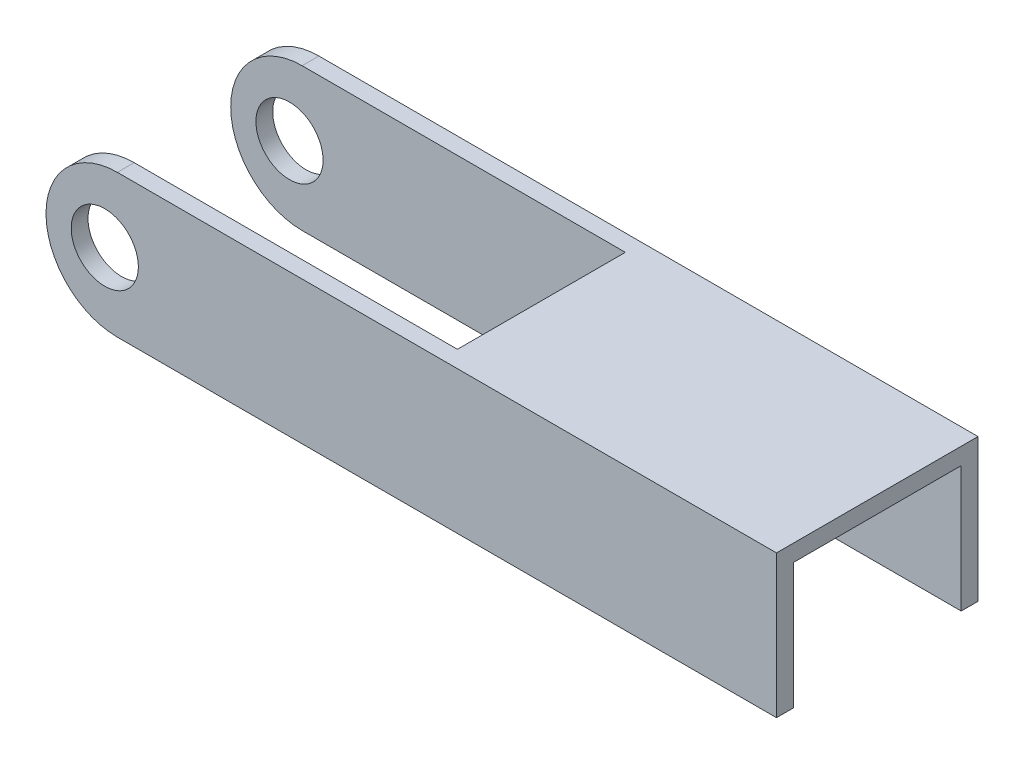
ISO-10303-21;
HEADER;
FILE_DESCRIPTION(('STEP AP214'),'2;1');
FILE_NAME('part.step','',(''),(''),'','','');
FILE_SCHEMA(('AUTOMOTIVE_DESIGN { 1 0 10303 214 1 1 1 1 }'));
ENDSEC;
DATA;
#1=APPLICATION_CONTEXT('core data for automotive mechanical design processes');
#2=APPLICATION_PROTOCOL_DEFINITION('international standard','automotive_design',2000,#1);
#3=PRODUCT_CONTEXT('',#1,'mechanical');
#4=PRODUCT('Part','Part','',(#3));
#5=PRODUCT_RELATED_PRODUCT_CATEGORY('part','',(#4));
#6=PRODUCT_DEFINITION_FORMATION('','',#4);
#7=PRODUCT_DEFINITION_CONTEXT('part definition',#1,'design');
#8=PRODUCT_DEFINITION('design','',#6,#7);
#9=PRODUCT_DEFINITION_SHAPE('','',#8);
#10=(LENGTH_UNIT() NAMED_UNIT(*) SI_UNIT(.MILLI.,.METRE.));
#11=(NAMED_UNIT(*) PLANE_ANGLE_UNIT() SI_UNIT($,.RADIAN.));
#12=(NAMED_UNIT(*) SI_UNIT($,.STERADIAN.) SOLID_ANGLE_UNIT());
#13=UNCERTAINTY_MEASURE_WITH_UNIT(LENGTH_MEASURE(1.E-05),#10,'distance_accuracy_value','');
#14=(GEOMETRIC_REPRESENTATION_CONTEXT(3) GLOBAL_UNCERTAINTY_ASSIGNED_CONTEXT((#13)) GLOBAL_UNIT_ASSIGNED_CONTEXT((#10,
#11,#12)) REPRESENTATION_CONTEXT('',''));
#15=CARTESIAN_POINT('',(0.,0.,0.));
#16=DIRECTION('',(0.,0.,1.));
#17=DIRECTION('',(1.,0.,0.));
#18=AXIS2_PLACEMENT_3D('',#15,#16,#17);
#19=CARTESIAN_POINT('',(-4.30348318368607,0.171520647505176,0.));
#20=DIRECTION('',(0.,0.,1.));
#21=DIRECTION('',(1.,0.,0.));
#22=AXIS2_PLACEMENT_3D('',#19,#20,#21);
#23=PLANE('',#22);
#24=CARTESIAN_POINT('',(-5.80348318368607,0.171520647505176,0.));
#25=DIRECTION('',(0.,0.,1.));
#26=DIRECTION('',(1.,0.,0.));
#27=AXIS2_PLACEMENT_3D('',#24,#25,#26);
#28=CIRCLE('',#27,4.);
#29=CARTESIAN_POINT('',(-1.80348318368607,0.171520647505176,0.));
#30=VERTEX_POINT('',#29);
#31=EDGE_CURVE('E191',#30,#30,#28,.T.);
#32=ORIENTED_EDGE('',*,*,#31,.T.);
#33=EDGE_LOOP('',(#32));
#34=FACE_BOUND('',#33,.T.);
#35=DIRECTION('',(0.,1.,0.));
#36=VECTOR('',#35,1.);
#37=CARTESIAN_POINT('',(34.1965168163139,8.67152064750518,0.));
#38=LINE('',#37,#36);
#39=CARTESIAN_POINT('',(34.1965168163139,6.67152064750518,0.));
#40=VERTEX_POINT('',#39);
#41=CARTESIAN_POINT('',(34.1965168163139,8.67152064750518,0.));
#42=VERTEX_POINT('',#41);
#43=EDGE_CURVE('E177',#40,#42,#38,.T.);
#44=ORIENTED_EDGE('',*,*,#43,.F.);
#45=DIRECTION('',(-1.,0.,0.));
#46=VECTOR('',#45,1.);
#47=CARTESIAN_POINT('',(34.1965168163139,6.67152064750518,0.));
#48=LINE('',#47,#46);
#49=CARTESIAN_POINT('',(74.1965168163139,6.67152064750518,0.));
#50=VERTEX_POINT('',#49);
#51=EDGE_CURVE('E62',#50,#40,#48,.T.);
#52=ORIENTED_EDGE('',*,*,#51,.F.);
#53=DIRECTION('',(0.,1.,0.));
#54=VECTOR('',#53,1.);
#55=CARTESIAN_POINT('',(74.1965168163139,8.67152064750518,0.));
#56=LINE('',#55,#54);
#57=CARTESIAN_POINT('',(74.1965168163139,-8.32847935249482,0.));
#58=VERTEX_POINT('',#57);
#59=EDGE_CURVE('E199',#58,#50,#56,.T.);
#60=ORIENTED_EDGE('',*,*,#59,.F.);
#61=DIRECTION('',(1.,0.,0.));
#62=VECTOR('',#61,1.);
#63=CARTESIAN_POINT('',(74.1965168163139,-8.32847935249482,0.));
#64=LINE('',#63,#62);
#65=CARTESIAN_POINT('',(-4.30348318368607,-8.32847935249482,0.));
#66=VERTEX_POINT('',#65);
#67=EDGE_CURVE('E207',#66,#58,#64,.T.);
#68=ORIENTED_EDGE('',*,*,#67,.F.);
#69=CARTESIAN_POINT('',(-4.30348318368607,0.171520647505176,0.));
#70=DIRECTION('',(0.,0.,1.));
#71=DIRECTION('',(1.,0.,0.));
#72=AXIS2_PLACEMENT_3D('',#69,#70,#71);
#73=CIRCLE('',#72,8.5);
#74=CARTESIAN_POINT('',(-4.30348318368607,8.67152064750518,0.));
#75=VERTEX_POINT('',#74);
#76=EDGE_CURVE('E205',#75,#66,#73,.T.);
#77=ORIENTED_EDGE('',*,*,#76,.F.);
#78=DIRECTION('',(-1.,0.,0.));
#79=VECTOR('',#78,1.);
#80=CARTESIAN_POINT('',(-4.30348318368607,8.67152064750518,0.));
#81=LINE('',#80,#79);
#82=EDGE_CURVE('E68',#42,#75,#81,.T.);
#83=ORIENTED_EDGE('',*,*,#82,.F.);
#84=EDGE_LOOP('',(#44,#52,#60,#68,#77,#83));
#85=FACE_BOUND('',#84,.T.);
#86=ADVANCED_FACE('F47',(#34,#85),#23,.F.);
#87=CARTESIAN_POINT('',(-4.30348318368607,0.171520647505176,2.));
#88=DIRECTION('',(0.,0.,1.));
#89=DIRECTION('',(1.,0.,0.));
#90=AXIS2_PLACEMENT_3D('',#87,#88,#89);
#91=PLANE('',#90);
#92=DIRECTION('',(-1.,0.,0.));
#93=VECTOR('',#92,1.);
#94=CARTESIAN_POINT('',(4.19651681631393,8.67152064750518,2.));
#95=LINE('',#94,#93);
#96=CARTESIAN_POINT('',(74.1965168163139,8.67152064750518,2.));
#97=VERTEX_POINT('',#96);
#98=CARTESIAN_POINT('',(-4.30348318368607,8.67152064750518,2.));
#99=VERTEX_POINT('',#98);
#100=EDGE_CURVE('E130',#97,#99,#95,.T.);
#101=ORIENTED_EDGE('',*,*,#100,.T.);
#102=CARTESIAN_POINT('',(-4.30348318368607,0.171520647505176,2.));
#103=DIRECTION('',(0.,0.,1.));
#104=DIRECTION('',(1.,0.,0.));
#105=AXIS2_PLACEMENT_3D('',#102,#103,#104);
#106=CIRCLE('',#105,8.5);
#107=CARTESIAN_POINT('',(-4.30348318368607,-8.32847935249482,2.));
#108=VERTEX_POINT('',#107);
#109=EDGE_CURVE('E198',#99,#108,#106,.T.);
#110=ORIENTED_EDGE('',*,*,#109,.T.);
#111=DIRECTION('',(1.,0.,0.));
#112=VECTOR('',#111,1.);
#113=CARTESIAN_POINT('',(74.1965168163139,-8.32847935249482,2.));
#114=LINE('',#113,#112);
#115=CARTESIAN_POINT('',(74.1965168163139,-8.32847935249482,2.));
#116=VERTEX_POINT('',#115);
#117=EDGE_CURVE('E201',#108,#116,#114,.T.);
#118=ORIENTED_EDGE('',*,*,#117,.T.);
#119=DIRECTION('',(0.,1.,0.));
#120=VECTOR('',#119,1.);
#121=CARTESIAN_POINT('',(74.1965168163139,8.67152064750518,2.));
#122=LINE('',#121,#120);
#123=EDGE_CURVE('E135',#116,#97,#122,.T.);
#124=ORIENTED_EDGE('',*,*,#123,.T.);
#125=EDGE_LOOP('',(#101,#110,#118,#124));
#126=FACE_BOUND('',#125,.T.);
#127=CARTESIAN_POINT('',(-5.80348318368607,0.171520647505176,2.));
#128=DIRECTION('',(0.,0.,1.));
#129=DIRECTION('',(1.,0.,0.));
#130=AXIS2_PLACEMENT_3D('',#127,#128,#129);
#131=CIRCLE('',#130,4.);
#132=CARTESIAN_POINT('',(-1.80348318368607,0.171520647505176,2.));
#133=VERTEX_POINT('',#132);
#134=EDGE_CURVE('E192',#133,#133,#131,.T.);
#135=ORIENTED_EDGE('',*,*,#134,.F.);
#136=EDGE_LOOP('',(#135));
#137=FACE_BOUND('',#136,.T.);
#138=ADVANCED_FACE('F247',(#126,#137),#91,.T.);
#139=CARTESIAN_POINT('',(-4.30348318368607,8.67152064750518,2.));
#140=DIRECTION('',(0.,-1.,0.));
#141=DIRECTION('',(0.,0.,-1.));
#142=AXIS2_PLACEMENT_3D('',#139,#140,#141);
#143=PLANE('',#142);
#144=DIRECTION('',(0.,0.,-1.));
#145=VECTOR('',#144,1.);
#146=CARTESIAN_POINT('',(74.1965168163139,8.67152064750518,2.));
#147=LINE('',#146,#145);
#148=CARTESIAN_POINT('',(74.1965168163139,8.67152064750518,-22.));
#149=VERTEX_POINT('',#148);
#150=EDGE_CURVE('E124',#97,#149,#147,.T.);
#151=ORIENTED_EDGE('',*,*,#150,.T.);
#152=DIRECTION('',(-1.,0.,0.));
#153=VECTOR('',#152,1.);
#154=CARTESIAN_POINT('',(4.19651681631393,8.67152064750518,-22.));
#155=LINE('',#154,#153);
#156=CARTESIAN_POINT('',(-4.30348318368607,8.67152064750518,-22.));
#157=VERTEX_POINT('',#156);
#158=EDGE_CURVE('E127',#149,#157,#155,.T.);
#159=ORIENTED_EDGE('',*,*,#158,.T.);
#160=DIRECTION('',(0.,0.,1.));
#161=VECTOR('',#160,1.);
#162=CARTESIAN_POINT('',(-4.30348318368607,8.67152064750518,-22.));
#163=LINE('',#162,#161);
#164=CARTESIAN_POINT('',(-4.30348318368607,8.67152064750518,-20.));
#165=VERTEX_POINT('',#164);
#166=EDGE_CURVE('E157',#157,#165,#163,.T.);
#167=ORIENTED_EDGE('',*,*,#166,.T.);
#168=DIRECTION('',(-1.,0.,0.));
#169=VECTOR('',#168,1.);
#170=CARTESIAN_POINT('',(-4.30348318368607,8.67152064750518,-20.));
#171=LINE('',#170,#169);
#172=CARTESIAN_POINT('',(34.1965168163139,8.67152064750518,-20.));
#173=VERTEX_POINT('',#172);
#174=EDGE_CURVE('E146',#173,#165,#171,.T.);
#175=ORIENTED_EDGE('',*,*,#174,.F.);
#176=DIRECTION('',(0.,0.,1.));
#177=VECTOR('',#176,1.);
#178=CARTESIAN_POINT('',(34.1965168163139,8.67152064750518,-20.));
#179=LINE('',#178,#177);
#180=EDGE_CURVE('E180',#173,#42,#179,.T.);
#181=ORIENTED_EDGE('',*,*,#180,.T.);
#182=ORIENTED_EDGE('',*,*,#82,.T.);
#183=DIRECTION('',(0.,0.,-1.));
#184=VECTOR('',#183,1.);
#185=CARTESIAN_POINT('',(-4.30348318368607,8.67152064750518,2.));
#186=LINE('',#185,#184);
#187=EDGE_CURVE('E13',#99,#75,#186,.T.);
#188=ORIENTED_EDGE('',*,*,#187,.F.);
#189=ORIENTED_EDGE('',*,*,#100,.F.);
#190=EDGE_LOOP('',(#151,#159,#167,#175,#181,#182,#188,#189));
#191=FACE_BOUND('',#190,.T.);
#192=ADVANCED_FACE('F49',(#191),#143,.F.);
#193=CARTESIAN_POINT('',(-4.30348318368607,0.171520647505176,2.));
#194=DIRECTION('',(0.,0.,-1.));
#195=DIRECTION('',(-1.,0.,0.));
#196=AXIS2_PLACEMENT_3D('',#193,#194,#195);
#197=CYLINDRICAL_SURFACE('',#196,8.5);
#198=ORIENTED_EDGE('',*,*,#76,.T.);
#199=DIRECTION('',(0.,0.,-1.));
#200=VECTOR('',#199,1.);
#201=CARTESIAN_POINT('',(-4.30348318368607,-8.32847935249482,2.));
#202=LINE('',#201,#200);
#203=EDGE_CURVE('E55',#108,#66,#202,.T.);
#204=ORIENTED_EDGE('',*,*,#203,.F.);
#205=ORIENTED_EDGE('',*,*,#109,.F.);
#206=ORIENTED_EDGE('',*,*,#187,.T.);
#207=EDGE_LOOP('',(#198,#204,#205,#206));
#208=FACE_BOUND('',#207,.T.);
#209=ADVANCED_FACE('F260',(#208),#197,.T.);
#210=CARTESIAN_POINT('',(74.1965168163139,-8.32847935249482,2.));
#211=DIRECTION('',(0.,1.,0.));
#212=DIRECTION('',(0.,0.,1.));
#213=AXIS2_PLACEMENT_3D('',#210,#211,#212);
#214=PLANE('',#213);
#215=ORIENTED_EDGE('',*,*,#67,.T.);
#216=DIRECTION('',(0.,0.,-1.));
#217=VECTOR('',#216,1.);
#218=CARTESIAN_POINT('',(74.1965168163139,-8.32847935249482,2.));
#219=LINE('',#218,#217);
#220=EDGE_CURVE('E134',#116,#58,#219,.T.);
#221=ORIENTED_EDGE('',*,*,#220,.F.);
#222=ORIENTED_EDGE('',*,*,#117,.F.);
#223=ORIENTED_EDGE('',*,*,#203,.T.);
#224=EDGE_LOOP('',(#215,#221,#222,#223));
#225=FACE_BOUND('',#224,.T.);
#226=ADVANCED_FACE('F216',(#225),#214,.F.);
#227=CARTESIAN_POINT('',(74.1965168163139,8.67152064750518,2.));
#228=DIRECTION('',(-1.,0.,0.));
#229=DIRECTION('',(0.,0.,1.));
#230=AXIS2_PLACEMENT_3D('',#227,#228,#229);
#231=PLANE('',#230);
#232=ORIENTED_EDGE('',*,*,#59,.T.);
#233=DIRECTION('',(0.,0.,1.));
#234=VECTOR('',#233,1.);
#235=CARTESIAN_POINT('',(74.1965168163139,6.67152064750518,-20.));
#236=LINE('',#235,#234);
#237=CARTESIAN_POINT('',(74.1965168163139,6.67152064750518,-20.));
#238=VERTEX_POINT('',#237);
#239=EDGE_CURVE('E188',#238,#50,#236,.T.);
#240=ORIENTED_EDGE('',*,*,#239,.F.);
#241=DIRECTION('',(0.,1.,0.));
#242=VECTOR('',#241,1.);
#243=CARTESIAN_POINT('',(74.1965168163139,8.67152064750518,-20.));
#244=LINE('',#243,#242);
#245=CARTESIAN_POINT('',(74.1965168163139,-8.32847935249482,-20.));
#246=VERTEX_POINT('',#245);
#247=EDGE_CURVE('E158',#246,#238,#244,.T.);
#248=ORIENTED_EDGE('',*,*,#247,.F.);
#249=DIRECTION('',(0.,0.,1.));
#250=VECTOR('',#249,1.);
#251=CARTESIAN_POINT('',(74.1965168163139,-8.32847935249482,-22.));
#252=LINE('',#251,#250);
#253=CARTESIAN_POINT('',(74.1965168163139,-8.32847935249482,-22.));
#254=VERTEX_POINT('',#253);
#255=EDGE_CURVE('E150',#254,#246,#252,.T.);
#256=ORIENTED_EDGE('',*,*,#255,.F.);
#257=DIRECTION('',(0.,1.,0.));
#258=VECTOR('',#257,1.);
#259=CARTESIAN_POINT('',(74.1965168163139,8.67152064750518,-22.));
#260=LINE('',#259,#258);
#261=EDGE_CURVE('E142',#254,#149,#260,.T.);
#262=ORIENTED_EDGE('',*,*,#261,.T.);
#263=ORIENTED_EDGE('',*,*,#150,.F.);
#264=ORIENTED_EDGE('',*,*,#123,.F.);
#265=ORIENTED_EDGE('',*,*,#220,.T.);
#266=EDGE_LOOP('',(#232,#240,#248,#256,#262,#263,#264,#265));
#267=FACE_BOUND('',#266,.T.);
#268=ADVANCED_FACE('F148',(#267),#231,.F.);
#269=CARTESIAN_POINT('',(-5.80348318368607,0.171520647505176,2.));
#270=DIRECTION('',(0.,0.,-1.));
#271=DIRECTION('',(-1.,0.,0.));
#272=AXIS2_PLACEMENT_3D('',#269,#270,#271);
#273=CYLINDRICAL_SURFACE('',#272,4.);
#274=ORIENTED_EDGE('',*,*,#134,.T.);
#275=EDGE_LOOP('',(#274));
#276=FACE_BOUND('',#275,.T.);
#277=ORIENTED_EDGE('',*,*,#31,.F.);
#278=EDGE_LOOP('',(#277));
#279=FACE_BOUND('',#278,.T.);
#280=ADVANCED_FACE('F243',(#276,#279),#273,.F.);
#281=CARTESIAN_POINT('',(34.1965168163139,6.67152064750518,-20.));
#282=DIRECTION('',(0.,1.,0.));
#283=DIRECTION('',(0.,0.,1.));
#284=AXIS2_PLACEMENT_3D('',#281,#282,#283);
#285=PLANE('',#284);
#286=ORIENTED_EDGE('',*,*,#51,.T.);
#287=DIRECTION('',(0.,0.,1.));
#288=VECTOR('',#287,1.);
#289=CARTESIAN_POINT('',(34.1965168163139,6.67152064750518,-20.));
#290=LINE('',#289,#288);
#291=CARTESIAN_POINT('',(34.1965168163139,6.67152064750518,-20.));
#292=VERTEX_POINT('',#291);
#293=EDGE_CURVE('E185',#292,#40,#290,.T.);
#294=ORIENTED_EDGE('',*,*,#293,.F.);
#295=DIRECTION('',(-1.,0.,0.));
#296=VECTOR('',#295,1.);
#297=CARTESIAN_POINT('',(34.1965168163139,6.67152064750518,-20.));
#298=LINE('',#297,#296);
#299=EDGE_CURVE('E173',#238,#292,#298,.T.);
#300=ORIENTED_EDGE('',*,*,#299,.F.);
#301=ORIENTED_EDGE('',*,*,#239,.T.);
#302=EDGE_LOOP('',(#286,#294,#300,#301));
#303=FACE_BOUND('',#302,.T.);
#304=ADVANCED_FACE('F222',(#303),#285,.F.);
#305=CARTESIAN_POINT('',(34.1965168163139,8.67152064750518,-20.));
#306=DIRECTION('',(1.,0.,0.));
#307=DIRECTION('',(0.,0.,-1.));
#308=AXIS2_PLACEMENT_3D('',#305,#306,#307);
#309=PLANE('',#308);
#310=ORIENTED_EDGE('',*,*,#43,.T.);
#311=ORIENTED_EDGE('',*,*,#180,.F.);
#312=DIRECTION('',(0.,1.,0.));
#313=VECTOR('',#312,1.);
#314=CARTESIAN_POINT('',(34.1965168163139,8.67152064750518,-20.));
#315=LINE('',#314,#313);
#316=EDGE_CURVE('E176',#292,#173,#315,.T.);
#317=ORIENTED_EDGE('',*,*,#316,.F.);
#318=ORIENTED_EDGE('',*,*,#293,.T.);
#319=EDGE_LOOP('',(#310,#311,#317,#318));
#320=FACE_BOUND('',#319,.T.);
#321=ADVANCED_FACE('F234',(#320),#309,.F.);
#322=CARTESIAN_POINT('',(-4.30348318368607,0.171520647505176,-20.));
#323=DIRECTION('',(0.,0.,-1.));
#324=DIRECTION('',(1.,0.,0.));
#325=AXIS2_PLACEMENT_3D('',#322,#323,#324);
#326=PLANE('',#325);
#327=CARTESIAN_POINT('',(-5.80348318368607,0.171520647505176,-20.));
#328=DIRECTION('',(0.,0.,1.));
#329=DIRECTION('',(1.,0.,0.));
#330=AXIS2_PLACEMENT_3D('',#327,#328,#329);
#331=CIRCLE('',#330,4.);
#332=CARTESIAN_POINT('',(-1.80348318368607,0.171520647505176,-20.));
#333=VERTEX_POINT('',#332);
#334=EDGE_CURVE('E338',#333,#333,#331,.T.);
#335=ORIENTED_EDGE('',*,*,#334,.F.);
#336=EDGE_LOOP('',(#335));
#337=FACE_BOUND('',#336,.T.);
#338=ORIENTED_EDGE('',*,*,#247,.T.);
#339=ORIENTED_EDGE('',*,*,#299,.T.);
#340=ORIENTED_EDGE('',*,*,#316,.T.);
#341=ORIENTED_EDGE('',*,*,#174,.T.);
#342=CARTESIAN_POINT('',(-4.30348318368607,0.171520647505176,-20.));
#343=DIRECTION('',(0.,0.,1.));
#344=DIRECTION('',(1.,0.,0.));
#345=AXIS2_PLACEMENT_3D('',#342,#343,#344);
#346=CIRCLE('',#345,8.5);
#347=CARTESIAN_POINT('',(-4.30348318368607,-8.32847935249482,-20.));
#348=VERTEX_POINT('',#347);
#349=EDGE_CURVE('E165',#165,#348,#346,.T.);
#350=ORIENTED_EDGE('',*,*,#349,.T.);
#351=DIRECTION('',(1.,0.,0.));
#352=VECTOR('',#351,1.);
#353=CARTESIAN_POINT('',(74.1965168163139,-8.32847935249482,-20.));
#354=LINE('',#353,#352);
#355=EDGE_CURVE('E161',#348,#246,#354,.T.);
#356=ORIENTED_EDGE('',*,*,#355,.T.);
#357=EDGE_LOOP('',(#338,#339,#340,#341,#350,#356));
#358=FACE_BOUND('',#357,.T.);
#359=ADVANCED_FACE('F225',(#337,#358),#326,.F.);
#360=CARTESIAN_POINT('',(74.1965168163139,-8.32847935249482,-22.));
#361=DIRECTION('',(0.,-1.,0.));
#362=DIRECTION('',(0.,0.,-1.));
#363=AXIS2_PLACEMENT_3D('',#360,#361,#362);
#364=PLANE('',#363);
#365=ORIENTED_EDGE('',*,*,#355,.F.);
#366=DIRECTION('',(0.,0.,1.));
#367=VECTOR('',#366,1.);
#368=CARTESIAN_POINT('',(-4.30348318368607,-8.32847935249482,-22.));
#369=LINE('',#368,#367);
#370=CARTESIAN_POINT('',(-4.30348318368607,-8.32847935249482,-22.));
#371=VERTEX_POINT('',#370);
#372=EDGE_CURVE('E170',#371,#348,#369,.T.);
#373=ORIENTED_EDGE('',*,*,#372,.F.);
#374=DIRECTION('',(1.,0.,0.));
#375=VECTOR('',#374,1.);
#376=CARTESIAN_POINT('',(74.1965168163139,-8.32847935249482,-22.));
#377=LINE('',#376,#375);
#378=EDGE_CURVE('E151',#371,#254,#377,.T.);
#379=ORIENTED_EDGE('',*,*,#378,.T.);
#380=ORIENTED_EDGE('',*,*,#255,.T.);
#381=EDGE_LOOP('',(#365,#373,#379,#380));
#382=FACE_BOUND('',#381,.T.);
#383=ADVANCED_FACE('F230',(#382),#364,.T.);
#384=CARTESIAN_POINT('',(-4.30348318368607,0.171520647505176,-22.));
#385=DIRECTION('',(0.,0.,1.));
#386=DIRECTION('',(1.,0.,0.));
#387=AXIS2_PLACEMENT_3D('',#384,#385,#386);
#388=CYLINDRICAL_SURFACE('',#387,8.5);
#389=ORIENTED_EDGE('',*,*,#349,.F.);
#390=ORIENTED_EDGE('',*,*,#166,.F.);
#391=CARTESIAN_POINT('',(-4.30348318368607,0.171520647505176,-22.));
#392=DIRECTION('',(0.,0.,1.));
#393=DIRECTION('',(1.,0.,0.));
#394=AXIS2_PLACEMENT_3D('',#391,#392,#393);
#395=CIRCLE('',#394,8.5);
#396=EDGE_CURVE('E145',#157,#371,#395,.T.);
#397=ORIENTED_EDGE('',*,*,#396,.T.);
#398=ORIENTED_EDGE('',*,*,#372,.T.);
#399=EDGE_LOOP('',(#389,#390,#397,#398));
#400=FACE_BOUND('',#399,.T.);
#401=ADVANCED_FACE('F232',(#400),#388,.T.);
#402=CARTESIAN_POINT('',(-4.30348318368607,0.171520647505176,-22.));
#403=DIRECTION('',(0.,0.,-1.));
#404=DIRECTION('',(1.,0.,0.));
#405=AXIS2_PLACEMENT_3D('',#402,#403,#404);
#406=PLANE('',#405);
#407=CARTESIAN_POINT('',(-5.80348318368607,0.171520647505176,-22.));
#408=DIRECTION('',(0.,0.,1.));
#409=DIRECTION('',(1.,0.,0.));
#410=AXIS2_PLACEMENT_3D('',#407,#408,#409);
#411=CIRCLE('',#410,4.);
#412=CARTESIAN_POINT('',(-1.80348318368607,0.171520647505176,-22.));
#413=VERTEX_POINT('',#412);
#414=EDGE_CURVE('E162',#413,#413,#411,.T.);
#415=ORIENTED_EDGE('',*,*,#414,.T.);
#416=EDGE_LOOP('',(#415));
#417=FACE_BOUND('',#416,.T.);
#418=ORIENTED_EDGE('',*,*,#158,.F.);
#419=ORIENTED_EDGE('',*,*,#261,.F.);
#420=ORIENTED_EDGE('',*,*,#378,.F.);
#421=ORIENTED_EDGE('',*,*,#396,.F.);
#422=EDGE_LOOP('',(#418,#419,#420,#421));
#423=FACE_BOUND('',#422,.T.);
#424=ADVANCED_FACE('F140',(#417,#423),#406,.T.);
#425=CARTESIAN_POINT('',(-5.80348318368607,0.171520647505176,-22.));
#426=DIRECTION('',(0.,0.,1.));
#427=DIRECTION('',(1.,0.,0.));
#428=AXIS2_PLACEMENT_3D('',#425,#426,#427);
#429=CYLINDRICAL_SURFACE('',#428,4.);
#430=ORIENTED_EDGE('',*,*,#414,.F.);
#431=EDGE_LOOP('',(#430));
#432=FACE_BOUND('',#431,.T.);
#433=ORIENTED_EDGE('',*,*,#334,.T.);
#434=EDGE_LOOP('',(#433));
#435=FACE_BOUND('',#434,.T.);
#436=ADVANCED_FACE('F319',(#432,#435),#429,.F.);
#437=CLOSED_SHELL('',(#86,#138,#192,#209,#226,#268,#280,#304,#321,#359,#383,#401,#424,#436));
#438=MANIFOLD_SOLID_BREP('B2',#437);
#439=ADVANCED_BREP_SHAPE_REPRESENTATION('',(#18,#438),#14);
#440=SHAPE_DEFINITION_REPRESENTATION(#9,#439);
ENDSEC;
END-ISO-10303-21;
